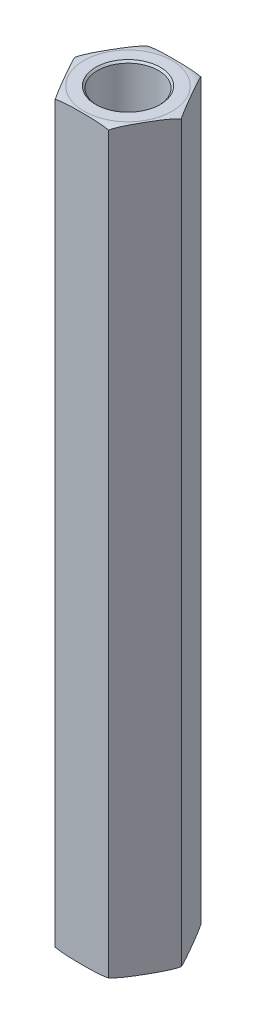
ISO-10303-21;
HEADER;
FILE_DESCRIPTION(('STEP AP214'),'2;1');
FILE_NAME('part.step','',(''),(''),'','','');
FILE_SCHEMA(('AUTOMOTIVE_DESIGN { 1 0 10303 214 1 1 1 1 }'));
ENDSEC;
DATA;
#1=APPLICATION_CONTEXT('core data for automotive mechanical design processes');
#2=APPLICATION_PROTOCOL_DEFINITION('international standard','automotive_design',2000,#1);
#3=PRODUCT_CONTEXT('',#1,'mechanical');
#4=PRODUCT('Part','Part','',(#3));
#5=PRODUCT_RELATED_PRODUCT_CATEGORY('part','',(#4));
#6=PRODUCT_DEFINITION_FORMATION('','',#4);
#7=PRODUCT_DEFINITION_CONTEXT('part definition',#1,'design');
#8=PRODUCT_DEFINITION('design','',#6,#7);
#9=PRODUCT_DEFINITION_SHAPE('','',#8);
#10=(LENGTH_UNIT() NAMED_UNIT(*) SI_UNIT(.MILLI.,.METRE.));
#11=(NAMED_UNIT(*) PLANE_ANGLE_UNIT() SI_UNIT($,.RADIAN.));
#12=(NAMED_UNIT(*) SI_UNIT($,.STERADIAN.) SOLID_ANGLE_UNIT());
#13=UNCERTAINTY_MEASURE_WITH_UNIT(LENGTH_MEASURE(1.E-05),#10,'distance_accuracy_value','');
#14=(GEOMETRIC_REPRESENTATION_CONTEXT(3) GLOBAL_UNCERTAINTY_ASSIGNED_CONTEXT((#13)) GLOBAL_UNIT_ASSIGNED_CONTEXT((#10,
#11,#12)) REPRESENTATION_CONTEXT('',''));
#15=CARTESIAN_POINT('',(0.,0.,0.));
#16=DIRECTION('',(0.,0.,1.));
#17=DIRECTION('',(1.,0.,0.));
#18=AXIS2_PLACEMENT_3D('',#15,#16,#17);
#19=CARTESIAN_POINT('',(0.,12.7,0.));
#20=DIRECTION('',(0.,1.,0.));
#21=DIRECTION('',(0.,0.,1.));
#22=AXIS2_PLACEMENT_3D('',#19,#20,#21);
#23=PLANE('',#22);
#24=CARTESIAN_POINT('',(0.,12.7,0.));
#25=DIRECTION('',(0.,1.,0.));
#26=DIRECTION('',(0.,0.,1.));
#27=AXIS2_PLACEMENT_3D('',#24,#25,#26);
#28=CIRCLE('',#27,2.0955);
#29=CARTESIAN_POINT('',(0.,12.7,2.0955));
#30=VERTEX_POINT('',#29);
#31=EDGE_CURVE('E302',#30,#30,#28,.T.);
#32=ORIENTED_EDGE('',*,*,#31,.T.);
#33=EDGE_LOOP('',(#32));
#34=FACE_BOUND('',#33,.T.);
#35=ADVANCED_FACE('F16',(#34),#23,.T.);
#36=CARTESIAN_POINT('',(0.,-12.7,0.));
#37=DIRECTION('',(0.,-1.,0.));
#38=DIRECTION('',(0.,0.,-1.));
#39=AXIS2_PLACEMENT_3D('',#36,#37,#38);
#40=PLANE('',#39);
#41=CARTESIAN_POINT('',(0.,-12.7,0.));
#42=DIRECTION('',(0.,-1.,0.));
#43=DIRECTION('',(0.,0.,-1.));
#44=AXIS2_PLACEMENT_3D('',#41,#42,#43);
#45=CIRCLE('',#44,2.0955);
#46=CARTESIAN_POINT('',(0.,-12.7,-2.0955));
#47=VERTEX_POINT('',#46);
#48=EDGE_CURVE('E312',#47,#47,#45,.T.);
#49=ORIENTED_EDGE('',*,*,#48,.T.);
#50=EDGE_LOOP('',(#49));
#51=FACE_BOUND('',#50,.T.);
#52=ADVANCED_FACE('F407',(#51),#40,.T.);
#53=CARTESIAN_POINT('',(0.,12.7,0.));
#54=DIRECTION('',(0.,1.,0.));
#55=DIRECTION('',(0.,0.,1.));
#56=AXIS2_PLACEMENT_3D('',#53,#54,#55);
#57=CYLINDRICAL_SURFACE('',#56,2.0955);
#58=CARTESIAN_POINT('',(0.,25.2729999999701,0.));
#59=DIRECTION('',(0.,1.,0.));
#60=DIRECTION('',(0.,0.,1.));
#61=AXIS2_PLACEMENT_3D('',#58,#59,#60);
#62=CIRCLE('',#61,2.09549999993897);
#63=CARTESIAN_POINT('',(0.,25.2729999999701,2.09549999993897));
#64=VERTEX_POINT('',#63);
#65=EDGE_CURVE('E314',#64,#64,#62,.T.);
#66=ORIENTED_EDGE('',*,*,#65,.T.);
#67=EDGE_LOOP('',(#66));
#68=FACE_BOUND('',#67,.T.);
#69=ORIENTED_EDGE('',*,*,#31,.F.);
#70=EDGE_LOOP('',(#69));
#71=FACE_BOUND('',#70,.T.);
#72=ADVANCED_FACE('F324',(#68,#71),#57,.F.);
#73=CARTESIAN_POINT('',(0.,-12.7,0.));
#74=DIRECTION('',(0.,-1.,0.));
#75=DIRECTION('',(0.,0.,-1.));
#76=AXIS2_PLACEMENT_3D('',#73,#74,#75);
#77=CYLINDRICAL_SURFACE('',#76,2.0955);
#78=ORIENTED_EDGE('',*,*,#48,.F.);
#79=EDGE_LOOP('',(#78));
#80=FACE_BOUND('',#79,.T.);
#81=CARTESIAN_POINT('',(0.,-25.2729999999701,0.));
#82=DIRECTION('',(0.,-1.,0.));
#83=DIRECTION('',(0.,0.,-1.));
#84=AXIS2_PLACEMENT_3D('',#81,#82,#83);
#85=CIRCLE('',#84,2.09549999999581);
#86=CARTESIAN_POINT('',(0.,-25.2729999999701,-2.09549999999581));
#87=VERTEX_POINT('',#86);
#88=EDGE_CURVE('E154',#87,#87,#85,.T.);
#89=ORIENTED_EDGE('',*,*,#88,.T.);
#90=EDGE_LOOP('',(#89));
#91=FACE_BOUND('',#90,.T.);
#92=ADVANCED_FACE('F329',(#80,#91),#77,.F.);
#93=CARTESIAN_POINT('',(0.,25.3999999998769,0.));
#94=DIRECTION('',(0.,1.,0.));
#95=DIRECTION('',(-1.,0.,0.));
#96=AXIS2_PLACEMENT_3D('',#93,#94,#95);
#97=CONICAL_SURFACE('',#96,2.2224999998457,0.785398163397448);
#98=CARTESIAN_POINT('',(0.,25.3999999999905,0.));
#99=DIRECTION('',(0.,1.,0.));
#100=DIRECTION('',(-1.,0.,0.));
#101=AXIS2_PLACEMENT_3D('',#98,#99,#100);
#102=CIRCLE('',#101,2.22249999995938);
#103=CARTESIAN_POINT('',(-2.22249999995938,25.3999999999905,0.));
#104=VERTEX_POINT('',#103);
#105=EDGE_CURVE('E79',#104,#104,#102,.T.);
#106=ORIENTED_EDGE('',*,*,#105,.T.);
#107=EDGE_LOOP('',(#106));
#108=FACE_BOUND('',#107,.T.);
#109=ORIENTED_EDGE('',*,*,#65,.F.);
#110=EDGE_LOOP('',(#109));
#111=FACE_BOUND('',#110,.T.);
#112=ADVANCED_FACE('F327',(#108,#111),#97,.F.);
#113=CARTESIAN_POINT('',(-3.66617420935413,25.4,0.));
#114=DIRECTION('',(0.866025403784439,0.,-0.499999999999999));
#115=DIRECTION('',(-0.499999999999999,0.,-0.866025403784439));
#116=AXIS2_PLACEMENT_3D('',#113,#114,#115);
#117=PLANE('',#116);
#118=DIRECTION('',(0.,1.,0.));
#119=VECTOR('',#118,1.);
#120=CARTESIAN_POINT('',(-1.83308710467708,25.4,3.175));
#121=LINE('',#120,#119);
#122=CARTESIAN_POINT('',(-1.83308710467707,-25.273,3.17499999999999));
#123=VERTEX_POINT('',#122);
#124=CARTESIAN_POINT('',(-1.83308710467706,25.273,3.175));
#125=VERTEX_POINT('',#124);
#126=EDGE_CURVE('E75',#123,#125,#121,.T.);
#127=ORIENTED_EDGE('',*,*,#126,.T.);
#128=CARTESIAN_POINT('',(-3.66617420935412,25.273,0.));
#129=CARTESIAN_POINT('',(-3.62797961467395,25.2889014148997,0.0661549785605581));
#130=CARTESIAN_POINT('',(-3.58956810864158,25.3024886076105,0.132685658603871));
#131=CARTESIAN_POINT('',(-3.51249051795712,25.3258161979402,0.266187961794345));
#132=CARTESIAN_POINT('',(-3.47382473049848,25.3355604771397,0.333159070187372));
#133=CARTESIAN_POINT('',(-3.39641631867875,25.3519966530451,0.467234372392355));
#134=CARTESIAN_POINT('',(-3.35767399633315,25.3586945328669,0.534338043098154));
#135=CARTESIAN_POINT('',(-3.28009834620116,25.3697767572932,0.668703010556943));
#136=CARTESIAN_POINT('',(-3.24126499587774,25.374160450474,0.735964346345226));
#137=CARTESIAN_POINT('',(-3.16354065964318,25.3812403004263,0.870586845688048));
#138=CARTESIAN_POINT('',(-3.1246496537448,25.3839355237591,0.937948043861515));
#139=CARTESIAN_POINT('',(-3.04685144594597,25.3881531983713,1.07269849250688));
#140=CARTESIAN_POINT('',(-3.00794424351974,25.3896756080272,1.14008774388949));
#141=CARTESIAN_POINT('',(-2.93051517598878,25.391922705889,1.27419882283578));
#142=CARTESIAN_POINT('',(-2.8919933624894,25.3926552468181,1.34092056101641));
#143=CARTESIAN_POINT('',(-2.81494778346149,25.3935767302574,1.4743674183913));
#144=CARTESIAN_POINT('',(-2.77642401791445,25.3937656658949,1.54109253761765));
#145=CARTESIAN_POINT('',(-2.69935964431019,25.3936659966806,1.67457194815371));
#146=CARTESIAN_POINT('',(-2.66081903631828,25.3933771811766,1.74132623935029));
#147=CARTESIAN_POINT('',(-2.58373908085337,25.392221986219,1.87483263846066));
#148=CARTESIAN_POINT('',(-2.54519973341253,25.3913555970386,1.94158474631875));
#149=CARTESIAN_POINT('',(-2.46812969629779,25.3887861940656,2.0750739663427));
#150=CARTESIAN_POINT('',(-2.42959900625973,25.3870832271617,2.1418110791393));
#151=CARTESIAN_POINT('',(-2.35255651340917,25.3824387229726,2.27525259109823));
#152=CARTESIAN_POINT('',(-2.31404470975451,25.3794972471358,2.34195699171921));
#153=CARTESIAN_POINT('',(-2.25084206239953,25.3732174124749,2.4514271881109));
#154=CARTESIAN_POINT('',(-2.22613849337018,25.3703980110463,2.49421502479802));
#155=CARTESIAN_POINT('',(-2.17676945272235,25.3638696794304,2.579724711521));
#156=CARTESIAN_POINT('',(-2.1521039703419,25.3601610809139,2.62244658019713));
#157=CARTESIAN_POINT('',(-2.10282753811702,25.3516802711497,2.70779586442636));
#158=CARTESIAN_POINT('',(-2.07821657107534,25.3469084657009,2.75042330976594));
#159=CARTESIAN_POINT('',(-2.02900094683554,25.3360987712516,2.83566727147549));
#160=CARTESIAN_POINT('',(-2.00439646085467,25.3300577313084,2.87828349128847));
#161=CARTESIAN_POINT('',(-1.95527325900936,25.3165138354161,2.96336737271501));
#162=CARTESIAN_POINT('',(-1.93075459617617,25.309010197803,3.00583494247576));
#163=CARTESIAN_POINT('',(-1.88182157373173,25.2923203507084,3.09058942351743));
#164=CARTESIAN_POINT('',(-1.85740744053271,25.2831314978033,3.13287594264089));
#165=CARTESIAN_POINT('',(-1.83308710467707,25.273,3.175));
#166=B_SPLINE_CURVE_WITH_KNOTS('',3,(#128,#129,#130,#131,#132,#133,#134,#135,#136,#137,#138,
#139,#140,#141,#142,#143,#144,#145,#146,#147,#148,#149,#150,#151,#152,#153,#154,#155,#156,#157,
#158,#159,#160,#161,#162,#163,#164,#165),.UNSPECIFIED.,.F.,.F.,(4,2,2,2,2,2,2,2,2,2,2,2,2,2,2,2,
2,2,4),(0.,0.233977307817926,0.467717675040663,0.700996973557454,0.934341903229689,
1.16781571967232,1.40129782179815,1.63243665809659,1.86357841666605,2.09482211846281,
2.3260697147148,2.55730435147381,2.78852751694395,2.93698369265072,3.08538458004461,
3.23372892334575,3.38244598546606,3.5312427462608,3.68027493713584),.UNSPECIFIED.);
#167=CARTESIAN_POINT('',(-3.66617420935412,25.273,0.));
#168=VERTEX_POINT('',#167);
#169=EDGE_CURVE('E68',#168,#125,#166,.T.);
#170=ORIENTED_EDGE('',*,*,#169,.F.);
#171=DIRECTION('',(0.,1.,0.));
#172=VECTOR('',#171,1.);
#173=CARTESIAN_POINT('',(-3.66617420935413,25.4,0.));
#174=LINE('',#173,#172);
#175=CARTESIAN_POINT('',(-3.66617420935413,-25.273,0.));
#176=VERTEX_POINT('',#175);
#177=EDGE_CURVE('E72',#168,#176,#174,.F.);
#178=ORIENTED_EDGE('',*,*,#177,.T.);
#179=CARTESIAN_POINT('',(-1.83308710467707,-25.273,3.17499999999999));
#180=CARTESIAN_POINT('',(-1.87128169935724,-25.2889014148997,3.10884502143944));
#181=CARTESIAN_POINT('',(-1.90969320538962,-25.3024886076105,3.04231434139612));
#182=CARTESIAN_POINT('',(-1.98677079607407,-25.3258161979402,2.90881203820565));
#183=CARTESIAN_POINT('',(-2.02543658353272,-25.3355604771397,2.84184092981262));
#184=CARTESIAN_POINT('',(-2.10284499535244,-25.3519966530451,2.70776562760764));
#185=CARTESIAN_POINT('',(-2.14158731769805,-25.3586945328669,2.64066195690184));
#186=CARTESIAN_POINT('',(-2.21916296783003,-25.3697767572932,2.50629698944305));
#187=CARTESIAN_POINT('',(-2.25799631815345,-25.374160450474,2.43903565365477));
#188=CARTESIAN_POINT('',(-2.33572065438801,-25.3812403004263,2.30441315431195));
#189=CARTESIAN_POINT('',(-2.3746116602864,-25.3839355237591,2.23705195613848));
#190=CARTESIAN_POINT('',(-2.45240986808522,-25.3881531983713,2.10230150749311));
#191=CARTESIAN_POINT('',(-2.49131707051146,-25.3896756080272,2.03491225611051));
#192=CARTESIAN_POINT('',(-2.56874613804241,-25.391922705889,1.90080117716421));
#193=CARTESIAN_POINT('',(-2.6072679515418,-25.3926552468181,1.83407943898358));
#194=CARTESIAN_POINT('',(-2.6843135305697,-25.3935767302574,1.70063258160869));
#195=CARTESIAN_POINT('',(-2.72283729611674,-25.3937656658949,1.63390746238234));
#196=CARTESIAN_POINT('',(-2.79990166972101,-25.3936659966806,1.50042805184629));
#197=CARTESIAN_POINT('',(-2.83844227771291,-25.3933771811766,1.43367376064971));
#198=CARTESIAN_POINT('',(-2.91552223317783,-25.392221986219,1.30016736153933));
#199=CARTESIAN_POINT('',(-2.95406158061867,-25.3913555970386,1.23341525368124));
#200=CARTESIAN_POINT('',(-3.03113161773341,-25.3887861940656,1.09992603365729));
#201=CARTESIAN_POINT('',(-3.06966230777146,-25.3870832271617,1.0331889208607));
#202=CARTESIAN_POINT('',(-3.14670480062202,-25.3824387229726,0.899747408901762));
#203=CARTESIAN_POINT('',(-3.18521660427668,-25.3794972471358,0.83304300828078));
#204=CARTESIAN_POINT('',(-3.24841925163166,-25.3732174124749,0.723572811889093));
#205=CARTESIAN_POINT('',(-3.27312282066101,-25.3703980110463,0.68078497520197));
#206=CARTESIAN_POINT('',(-3.32249186130884,-25.3638696794304,0.595275288478995));
#207=CARTESIAN_POINT('',(-3.34715734368929,-25.3601610809139,0.552553419802863));
#208=CARTESIAN_POINT('',(-3.39643377591418,-25.3516802711497,0.467204135573639));
#209=CARTESIAN_POINT('',(-3.42104474295585,-25.3469084657009,0.424576690234056));
#210=CARTESIAN_POINT('',(-3.47026036719565,-25.3360987712516,0.3393327285245));
#211=CARTESIAN_POINT('',(-3.49486485317652,-25.3300577313084,0.296716508711522));
#212=CARTESIAN_POINT('',(-3.54398805502183,-25.3165138354161,0.211632627284986));
#213=CARTESIAN_POINT('',(-3.56850671785503,-25.309010197803,0.169165057524237));
#214=CARTESIAN_POINT('',(-3.61743974029946,-25.2923203507084,0.0844105764825622));
#215=CARTESIAN_POINT('',(-3.64185387349848,-25.2831314978033,0.0421240573591058));
#216=CARTESIAN_POINT('',(-3.66617420935413,-25.273,0.));
#217=B_SPLINE_CURVE_WITH_KNOTS('',3,(#179,#180,#181,#182,#183,#184,#185,#186,#187,#188,#189,
#190,#191,#192,#193,#194,#195,#196,#197,#198,#199,#200,#201,#202,#203,#204,#205,#206,#207,#208,
#209,#210,#211,#212,#213,#214,#215,#216),.UNSPECIFIED.,.F.,.F.,(4,2,2,2,2,2,2,2,2,2,2,2,2,2,2,2,
2,2,4),(0.,0.233977307817926,0.467717675040663,0.700996973557454,0.934341903229688,
1.16781571967232,1.40129782179815,1.63243665809659,1.86357841666605,2.0948221184628,
2.3260697147148,2.55730435147381,2.78852751694395,2.93698369265072,3.08538458004461,
3.23372892334575,3.38244598546606,3.5312427462608,3.68027493713584),.UNSPECIFIED.);
#218=EDGE_CURVE('E87',#123,#176,#217,.T.);
#219=ORIENTED_EDGE('',*,*,#218,.F.);
#220=EDGE_LOOP('',(#127,#170,#178,#219));
#221=FACE_BOUND('',#220,.T.);
#222=ADVANCED_FACE('F70',(#221),#117,.F.);
#223=CARTESIAN_POINT('',(0.,-25.3999999998769,0.));
#224=DIRECTION('',(0.,-1.,0.));
#225=DIRECTION('',(1.,0.,0.));
#226=AXIS2_PLACEMENT_3D('',#223,#224,#225);
#227=CONICAL_SURFACE('',#226,2.22249999990254,0.785398163173655);
#228=ORIENTED_EDGE('',*,*,#88,.F.);
#229=EDGE_LOOP('',(#228));
#230=FACE_BOUND('',#229,.T.);
#231=CARTESIAN_POINT('',(0.,-25.3999999999337,0.));
#232=DIRECTION('',(0.,-1.,0.));
#233=DIRECTION('',(1.,0.,0.));
#234=AXIS2_PLACEMENT_3D('',#231,#232,#233);
#235=CIRCLE('',#234,2.22249999995938);
#236=CARTESIAN_POINT('',(2.22249999995938,-25.3999999999337,0.));
#237=VERTEX_POINT('',#236);
#238=EDGE_CURVE('E278',#237,#237,#235,.F.);
#239=ORIENTED_EDGE('',*,*,#238,.F.);
#240=EDGE_LOOP('',(#239));
#241=FACE_BOUND('',#240,.T.);
#242=ADVANCED_FACE('F336',(#230,#241),#227,.F.);
#243=CARTESIAN_POINT('',(-1.83308710467707,25.4,-3.175));
#244=DIRECTION('',(0.,-1.,0.));
#245=DIRECTION('',(0.,0.,-1.));
#246=AXIS2_PLACEMENT_3D('',#243,#244,#245);
#247=PLANE('',#246);
#248=CARTESIAN_POINT('',(0.,25.4,0.));
#249=DIRECTION('',(0.,-1.,0.));
#250=DIRECTION('',(0.,0.,1.));
#251=AXIS2_PLACEMENT_3D('',#248,#249,#250);
#252=CIRCLE('',#251,3.03117420935412);
#253=CARTESIAN_POINT('',(0.,25.4,3.03117420935412));
#254=VERTEX_POINT('',#253);
#255=CARTESIAN_POINT('',(0.,25.4,-3.03117420935412));
#256=VERTEX_POINT('',#255);
#257=EDGE_CURVE('E78',#254,#256,#252,.T.);
#258=ORIENTED_EDGE('',*,*,#257,.F.);
#259=CARTESIAN_POINT('',(0.,25.4,0.));
#260=DIRECTION('',(0.,-1.,0.));
#261=DIRECTION('',(0.,0.,-1.));
#262=AXIS2_PLACEMENT_3D('',#259,#260,#261);
#263=CIRCLE('',#262,3.03117420935412);
#264=EDGE_CURVE('E139',#256,#254,#263,.T.);
#265=ORIENTED_EDGE('',*,*,#264,.F.);
#266=EDGE_LOOP('',(#258,#265));
#267=FACE_BOUND('',#266,.T.);
#268=ORIENTED_EDGE('',*,*,#105,.F.);
#269=EDGE_LOOP('',(#268));
#270=FACE_BOUND('',#269,.T.);
#271=ADVANCED_FACE('F115',(#267,#270),#247,.F.);
#272=CARTESIAN_POINT('',(-1.83308710467707,25.4,-3.175));
#273=DIRECTION('',(0.866025403784439,0.,0.5));
#274=DIRECTION('',(0.5,0.,-0.866025403784439));
#275=AXIS2_PLACEMENT_3D('',#272,#273,#274);
#276=PLANE('',#275);
#277=ORIENTED_EDGE('',*,*,#177,.F.);
#278=CARTESIAN_POINT('',(-1.83308710467706,25.273,-3.17500000000001));
#279=CARTESIAN_POINT('',(-1.87128169935723,25.2889014148997,-3.10884502143946));
#280=CARTESIAN_POINT('',(-1.9096932053896,25.3024886076105,-3.04231434139615));
#281=CARTESIAN_POINT('',(-1.98677079607406,25.3258161979402,-2.90881203820568));
#282=CARTESIAN_POINT('',(-2.0254365835327,25.3355604771397,-2.84184092981265));
#283=CARTESIAN_POINT('',(-2.10284499535242,25.3519966530451,-2.70776562760767));
#284=CARTESIAN_POINT('',(-2.14158731769803,25.3586945328669,-2.64066195690188));
#285=CARTESIAN_POINT('',(-2.21916296783001,25.3697767572932,-2.50629698944309));
#286=CARTESIAN_POINT('',(-2.25799631815343,25.374160450474,-2.43903565365481));
#287=CARTESIAN_POINT('',(-2.33572065438799,25.3812403004263,-2.30441315431199));
#288=CARTESIAN_POINT('',(-2.37461166028637,25.3839355237591,-2.23705195613853));
#289=CARTESIAN_POINT('',(-2.45240986808519,25.3881531983713,-2.10230150749317));
#290=CARTESIAN_POINT('',(-2.49131707051143,25.3896756080272,-2.03491225611056));
#291=CARTESIAN_POINT('',(-2.56874613804238,25.391922705889,-1.90080117716427));
#292=CARTESIAN_POINT('',(-2.60726795154177,25.3926552468181,-1.83407943898364));
#293=CARTESIAN_POINT('',(-2.68431353056967,25.3935767302574,-1.70063258160875));
#294=CARTESIAN_POINT('',(-2.72283729611671,25.3937656658949,-1.63390746238241));
#295=CARTESIAN_POINT('',(-2.79990166972097,25.3936659966806,-1.50042805184636));
#296=CARTESIAN_POINT('',(-2.83844227771288,25.3933771811766,-1.43367376064978));
#297=CARTESIAN_POINT('',(-2.91552223317778,25.392221986219,-1.30016736153941));
#298=CARTESIAN_POINT('',(-2.95406158061863,25.3913555970386,-1.23341525368132));
#299=CARTESIAN_POINT('',(-3.03113161773337,25.3887861940656,-1.09992603365738));
#300=CARTESIAN_POINT('',(-3.06966230777142,25.3870832271617,-1.03318892086078));
#301=CARTESIAN_POINT('',(-3.14670480062198,25.3824387229726,-0.899747408901851));
#302=CARTESIAN_POINT('',(-3.18521660427663,25.3794972471358,-0.83304300828087));
#303=CARTESIAN_POINT('',(-3.24841925163161,25.3732174124749,-0.723572811889181));
#304=CARTESIAN_POINT('',(-3.27312282066097,25.3703980110463,-0.680784975202054));
#305=CARTESIAN_POINT('',(-3.32249186130881,25.3638696794304,-0.595275288479069));
#306=CARTESIAN_POINT('',(-3.34715734368926,25.3601610809139,-0.552553419802932));
#307=CARTESIAN_POINT('',(-3.39643377591415,25.3516802711497,-0.467204135573698));
#308=CARTESIAN_POINT('',(-3.42104474295582,25.3469084657009,-0.42457669023411));
#309=CARTESIAN_POINT('',(-3.47026036719563,25.3360987712516,-0.339332728524545));
#310=CARTESIAN_POINT('',(-3.4948648531765,25.3300577313084,-0.296716508711561));
#311=CARTESIAN_POINT('',(-3.54398805502182,25.3165138354161,-0.211632627285015));
#312=CARTESIAN_POINT('',(-3.56850671785502,25.309010197803,-0.169165057524262));
#313=CARTESIAN_POINT('',(-3.61743974029946,25.2923203507084,-0.0844105764825773));
#314=CARTESIAN_POINT('',(-3.64185387349848,25.2831314978033,-0.0421240573591159));
#315=CARTESIAN_POINT('',(-3.66617420935413,25.273,0.));
#316=B_SPLINE_CURVE_WITH_KNOTS('',3,(#278,#279,#280,#281,#282,#283,#284,#285,#286,#287,#288,
#289,#290,#291,#292,#293,#294,#295,#296,#297,#298,#299,#300,#301,#302,#303,#304,#305,#306,#307,
#308,#309,#310,#311,#312,#313,#314,#315),.UNSPECIFIED.,.F.,.F.,(4,2,2,2,2,2,2,2,2,2,2,2,2,2,2,2,
2,2,4),(0.,0.23397730781792,0.46771767504065,0.700996973557435,0.934341903229662,
1.16781571967229,1.40129782179811,1.63243665809654,1.86357841666599,2.09482211846275,
2.32606971471473,2.55730435147374,2.78852751694387,2.93698369265066,3.08538458004457,
3.23372892334572,3.38244598546605,3.53124274626081,3.68027493713587),.UNSPECIFIED.);
#317=CARTESIAN_POINT('',(-1.83308710467705,25.273,-3.17500000000001));
#318=VERTEX_POINT('',#317);
#319=EDGE_CURVE('E84',#318,#168,#316,.T.);
#320=ORIENTED_EDGE('',*,*,#319,.F.);
#321=DIRECTION('',(0.,1.,0.));
#322=VECTOR('',#321,1.);
#323=CARTESIAN_POINT('',(-1.83308710467704,25.4,-3.175));
#324=LINE('',#323,#322);
#325=CARTESIAN_POINT('',(-1.83308710467707,-25.273,-3.175));
#326=VERTEX_POINT('',#325);
#327=EDGE_CURVE('E177',#318,#326,#324,.F.);
#328=ORIENTED_EDGE('',*,*,#327,.T.);
#329=CARTESIAN_POINT('',(-3.66617420935413,-25.273,0.));
#330=CARTESIAN_POINT('',(-3.62797961467396,-25.2889014148997,-0.0661549785605592));
#331=CARTESIAN_POINT('',(-3.58956810864158,-25.3024886076105,-0.132685658603871));
#332=CARTESIAN_POINT('',(-3.51249051795713,-25.3258161979402,-0.266187961794346));
#333=CARTESIAN_POINT('',(-3.47382473049848,-25.3355604771397,-0.333159070187372));
#334=CARTESIAN_POINT('',(-3.39641631867876,-25.3519966530451,-0.467234372392354));
#335=CARTESIAN_POINT('',(-3.35767399633315,-25.3586945328669,-0.534338043098152));
#336=CARTESIAN_POINT('',(-3.28009834620117,-25.3697767572932,-0.66870301055694));
#337=CARTESIAN_POINT('',(-3.24126499587775,-25.374160450474,-0.735964346345222));
#338=CARTESIAN_POINT('',(-3.16354065964319,-25.3812403004263,-0.870586845688043));
#339=CARTESIAN_POINT('',(-3.1246496537448,-25.3839355237591,-0.937948043861509));
#340=CARTESIAN_POINT('',(-3.04685144594598,-25.3881531983713,-1.07269849250688));
#341=CARTESIAN_POINT('',(-3.00794424351975,-25.3896756080272,-1.14008774388948));
#342=CARTESIAN_POINT('',(-2.93051517598879,-25.391922705889,-1.27419882283578));
#343=CARTESIAN_POINT('',(-2.8919933624894,-25.3926552468181,-1.3409205610164));
#344=CARTESIAN_POINT('',(-2.8149477834615,-25.3935767302574,-1.4743674183913));
#345=CARTESIAN_POINT('',(-2.77642401791446,-25.3937656658949,-1.54109253761764));
#346=CARTESIAN_POINT('',(-2.6993596443102,-25.3936659966806,-1.6745719481537));
#347=CARTESIAN_POINT('',(-2.66081903631829,-25.3933771811766,-1.74132623935028));
#348=CARTESIAN_POINT('',(-2.58373908085338,-25.392221986219,-1.87483263846065));
#349=CARTESIAN_POINT('',(-2.54519973341254,-25.3913555970386,-1.94158474631874));
#350=CARTESIAN_POINT('',(-2.4681296962978,-25.3887861940656,-2.07507396634269));
#351=CARTESIAN_POINT('',(-2.42959900625974,-25.3870832271617,-2.14181107913928));
#352=CARTESIAN_POINT('',(-2.35255651340918,-25.3824387229726,-2.27525259109822));
#353=CARTESIAN_POINT('',(-2.31404470975452,-25.3794972471358,-2.3419569917192));
#354=CARTESIAN_POINT('',(-2.25084206239954,-25.3732174124749,-2.45142718811088));
#355=CARTESIAN_POINT('',(-2.22613849337019,-25.3703980110463,-2.49421502479801));
#356=CARTESIAN_POINT('',(-2.17676945272236,-25.3638696794304,-2.57972471152098));
#357=CARTESIAN_POINT('',(-2.15210397034191,-25.3601610809139,-2.62244658019712));
#358=CARTESIAN_POINT('',(-2.10282753811703,-25.3516802711497,-2.70779586442634));
#359=CARTESIAN_POINT('',(-2.07821657107535,-25.3469084657009,-2.75042330976592));
#360=CARTESIAN_POINT('',(-2.02900094683555,-25.3360987712516,-2.83566727147548));
#361=CARTESIAN_POINT('',(-2.00439646085468,-25.3300577313084,-2.87828349128846));
#362=CARTESIAN_POINT('',(-1.95527325900937,-25.3165138354161,-2.963367372715));
#363=CARTESIAN_POINT('',(-1.93075459617617,-25.309010197803,-3.00583494247575));
#364=CARTESIAN_POINT('',(-1.88182157373174,-25.2923203507084,-3.09058942351742));
#365=CARTESIAN_POINT('',(-1.85740744053272,-25.2831314978033,-3.13287594264088));
#366=CARTESIAN_POINT('',(-1.83308710467707,-25.273,-3.17499999999999));
#367=B_SPLINE_CURVE_WITH_KNOTS('',3,(#329,#330,#331,#332,#333,#334,#335,#336,#337,#338,#339,
#340,#341,#342,#343,#344,#345,#346,#347,#348,#349,#350,#351,#352,#353,#354,#355,#356,#357,#358,
#359,#360,#361,#362,#363,#364,#365,#366),.UNSPECIFIED.,.F.,.F.,(4,2,2,2,2,2,2,2,2,2,2,2,2,2,2,2,
2,2,4),(0.,0.233977307817925,0.467717675040661,0.700996973557449,0.934341903229682,
1.16781571967231,1.40129782179814,1.63243665809658,1.86357841666603,2.09482211846279,
2.32606971471478,2.55730435147379,2.78852751694393,2.9369836926507,3.0853845800446,
3.23372892334574,3.38244598546605,3.53124274626079,3.68027493713583),.UNSPECIFIED.);
#368=EDGE_CURVE('E86',#176,#326,#367,.T.);
#369=ORIENTED_EDGE('',*,*,#368,.F.);
#370=EDGE_LOOP('',(#277,#320,#328,#369));
#371=FACE_BOUND('',#370,.T.);
#372=ADVANCED_FACE('F82',(#371),#276,.F.);
#373=CARTESIAN_POINT('',(-1.83308710467707,25.4,3.175));
#374=DIRECTION('',(0.,0.,-1.));
#375=DIRECTION('',(-1.,0.,0.));
#376=AXIS2_PLACEMENT_3D('',#373,#374,#375);
#377=PLANE('',#376);
#378=DIRECTION('',(0.,1.,0.));
#379=VECTOR('',#378,1.);
#380=CARTESIAN_POINT('',(1.83308710467706,25.4,3.17499999999999));
#381=LINE('',#380,#379);
#382=CARTESIAN_POINT('',(1.83308710467706,-25.273,3.17499999999999));
#383=VERTEX_POINT('',#382);
#384=CARTESIAN_POINT('',(1.83308710467706,25.273,3.17499999999999));
#385=VERTEX_POINT('',#384);
#386=EDGE_CURVE('E179',#383,#385,#381,.T.);
#387=ORIENTED_EDGE('',*,*,#386,.T.);
#388=CARTESIAN_POINT('',(-1.83308710467706,25.273,3.175));
#389=CARTESIAN_POINT('',(-1.73237579828683,25.2939400141518,3.175));
#390=CARTESIAN_POINT('',(-1.63096506893486,25.3108853495327,3.175));
#391=CARTESIAN_POINT('',(-1.42767146651469,25.3384971643984,3.175));
#392=CARTESIAN_POINT('',(-1.32579191427254,25.3491875658753,3.175));
#393=CARTESIAN_POINT('',(-1.12177634709138,25.3661280408079,3.175));
#394=CARTESIAN_POINT('',(-1.0196405664338,25.3723812707189,3.175));
#395=CARTESIAN_POINT('',(-0.815663681397376,25.3819028064183,3.175));
#396=CARTESIAN_POINT('',(-0.713823115514574,25.3851834044999,3.175));
#397=CARTESIAN_POINT('',(-0.510018485441651,25.3899454848703,3.175));
#398=CARTESIAN_POINT('',(-0.408054390577977,25.3914254100882,3.175));
#399=CARTESIAN_POINT('',(-0.204060200337871,25.3933146818379,3.175));
#400=CARTESIAN_POINT('',(-0.102030100168935,25.3937234241492,3.175));
#401=CARTESIAN_POINT('',(0.102030100168936,25.3937234241492,3.175));
#402=CARTESIAN_POINT('',(0.204060200337871,25.3933146818379,3.175));
#403=CARTESIAN_POINT('',(0.408054390577978,25.3914254100882,3.17499999999999));
#404=CARTESIAN_POINT('',(0.510018485441653,25.3899454848703,3.17499999999999));
#405=CARTESIAN_POINT('',(0.713823115514575,25.3851834044999,3.17499999999999));
#406=CARTESIAN_POINT('',(0.815663681397378,25.3819028064183,3.17499999999999));
#407=CARTESIAN_POINT('',(1.0196405664338,25.3723812707189,3.17499999999999));
#408=CARTESIAN_POINT('',(1.12177634709138,25.3661280408079,3.17499999999999));
#409=CARTESIAN_POINT('',(1.32579191427254,25.3491875658753,3.17499999999999));
#410=CARTESIAN_POINT('',(1.42767146651469,25.3384971643984,3.17499999999999));
#411=CARTESIAN_POINT('',(1.63096506893486,25.3108853495327,3.17499999999999));
#412=CARTESIAN_POINT('',(1.73237579828684,25.2939400141518,3.17499999999999));
#413=CARTESIAN_POINT('',(1.83308710467706,25.273,3.17499999999999));
#414=B_SPLINE_CURVE_WITH_KNOTS('',3,(#388,#389,#390,#391,#392,#393,#394,#395,#396,#397,#398,
#399,#400,#401,#402,#403,#404,#405,#406,#407,#408,#409,#410,#411,#412,#413),.UNSPECIFIED.,.F.,
.F.,(4,2,2,2,2,2,2,2,2,2,2,2,4),(0.,0.308333242342808,0.615479423308236,0.92240689113001,
1.2280592962085,1.53397581645216,1.84006485747889,2.14615389850562,2.45207041874928,
2.75772282382777,3.06465029164954,3.37179647261497,3.68012971495778),.UNSPECIFIED.);
#415=EDGE_CURVE('E273',#125,#385,#414,.T.);
#416=ORIENTED_EDGE('',*,*,#415,.F.);
#417=ORIENTED_EDGE('',*,*,#126,.F.);
#418=CARTESIAN_POINT('',(1.83308710467706,-25.273,3.17499999999999));
#419=CARTESIAN_POINT('',(1.73237579828684,-25.2939400141518,3.17499999999999));
#420=CARTESIAN_POINT('',(1.63096506893486,-25.3108853495327,3.17499999999999));
#421=CARTESIAN_POINT('',(1.4276714665147,-25.3384971643984,3.17499999999999));
#422=CARTESIAN_POINT('',(1.32579191427254,-25.3491875658753,3.17499999999999));
#423=CARTESIAN_POINT('',(1.12177634709138,-25.3661280408079,3.17499999999999));
#424=CARTESIAN_POINT('',(1.0196405664338,-25.3723812707189,3.17499999999999));
#425=CARTESIAN_POINT('',(0.815663681397379,-25.3819028064183,3.17499999999999));
#426=CARTESIAN_POINT('',(0.713823115514576,-25.3851834044999,3.17499999999999));
#427=CARTESIAN_POINT('',(0.510018485441653,-25.3899454848703,3.17499999999999));
#428=CARTESIAN_POINT('',(0.408054390577978,-25.3914254100882,3.17499999999999));
#429=CARTESIAN_POINT('',(0.204060200337871,-25.3933146818379,3.175));
#430=CARTESIAN_POINT('',(0.102030100168936,-25.3937234241492,3.175));
#431=CARTESIAN_POINT('',(-0.102030100168936,-25.3937234241492,3.175));
#432=CARTESIAN_POINT('',(-0.204060200337872,-25.3933146818379,3.175));
#433=CARTESIAN_POINT('',(-0.408054390577981,-25.3914254100882,3.175));
#434=CARTESIAN_POINT('',(-0.510018485441656,-25.3899454848703,3.175));
#435=CARTESIAN_POINT('',(-0.71382311551458,-25.3851834044999,3.175));
#436=CARTESIAN_POINT('',(-0.815663681397384,-25.3819028064183,3.175));
#437=CARTESIAN_POINT('',(-1.01964056643381,-25.3723812707189,3.175));
#438=CARTESIAN_POINT('',(-1.12177634709139,-25.3661280408079,3.175));
#439=CARTESIAN_POINT('',(-1.32579191427255,-25.3491875658753,3.175));
#440=CARTESIAN_POINT('',(-1.4276714665147,-25.3384971643984,3.175));
#441=CARTESIAN_POINT('',(-1.63096506893487,-25.3108853495327,3.175));
#442=CARTESIAN_POINT('',(-1.73237579828685,-25.2939400141518,3.175));
#443=CARTESIAN_POINT('',(-1.83308710467708,-25.273,3.175));
#444=B_SPLINE_CURVE_WITH_KNOTS('',3,(#418,#419,#420,#421,#422,#423,#424,#425,#426,#427,#428,
#429,#430,#431,#432,#433,#434,#435,#436,#437,#438,#439,#440,#441,#442,#443),.UNSPECIFIED.,.F.,
.F.,(4,2,2,2,2,2,2,2,2,2,2,2,4),(0.,0.308333242342808,0.615479423308238,0.922406891130012,
1.22805929620851,1.53397581645217,1.84006485747889,2.14615389850562,2.45207041874929,
2.75772282382778,3.06465029164956,3.37179647261499,3.6801297149578),.UNSPECIFIED.);
#445=EDGE_CURVE('E250',#383,#123,#444,.T.);
#446=ORIENTED_EDGE('',*,*,#445,.F.);
#447=EDGE_LOOP('',(#387,#416,#417,#446));
#448=FACE_BOUND('',#447,.T.);
#449=ADVANCED_FACE('F203',(#448),#377,.F.);
#450=CARTESIAN_POINT('',(-1.83308710467707,-25.4,-3.175));
#451=DIRECTION('',(0.,-1.,0.));
#452=DIRECTION('',(0.,0.,-1.));
#453=AXIS2_PLACEMENT_3D('',#450,#451,#452);
#454=PLANE('',#453);
#455=CARTESIAN_POINT('',(0.,-25.4,0.));
#456=DIRECTION('',(0.,1.,0.));
#457=DIRECTION('',(0.,0.,1.));
#458=AXIS2_PLACEMENT_3D('',#455,#456,#457);
#459=CIRCLE('',#458,3.03117420935413);
#460=CARTESIAN_POINT('',(0.,-25.4,3.03117420935412));
#461=VERTEX_POINT('',#460);
#462=CARTESIAN_POINT('',(0.,-25.4,-3.03117420935412));
#463=VERTEX_POINT('',#462);
#464=EDGE_CURVE('E189',#461,#463,#459,.T.);
#465=ORIENTED_EDGE('',*,*,#464,.F.);
#466=CARTESIAN_POINT('',(0.,-25.4,0.));
#467=DIRECTION('',(0.,1.,0.));
#468=DIRECTION('',(0.,0.,-1.));
#469=AXIS2_PLACEMENT_3D('',#466,#467,#468);
#470=CIRCLE('',#469,3.03117420935413);
#471=EDGE_CURVE('E182',#461,#463,#470,.F.);
#472=ORIENTED_EDGE('',*,*,#471,.T.);
#473=EDGE_LOOP('',(#465,#472));
#474=FACE_BOUND('',#473,.T.);
#475=ORIENTED_EDGE('',*,*,#238,.T.);
#476=EDGE_LOOP('',(#475));
#477=FACE_BOUND('',#476,.T.);
#478=ADVANCED_FACE('F194',(#474,#477),#454,.T.);
#479=CARTESIAN_POINT('',(1.83308710467706,25.4,3.17499999999999));
#480=DIRECTION('',(-0.866025403784439,0.,-0.5));
#481=DIRECTION('',(-0.5,0.,0.866025403784439));
#482=AXIS2_PLACEMENT_3D('',#479,#480,#481);
#483=PLANE('',#482);
#484=DIRECTION('',(0.,1.,0.));
#485=VECTOR('',#484,1.);
#486=CARTESIAN_POINT('',(3.66617420935412,25.4,0.));
#487=LINE('',#486,#485);
#488=CARTESIAN_POINT('',(3.66617420935412,-25.273,0.));
#489=VERTEX_POINT('',#488);
#490=CARTESIAN_POINT('',(3.66617420935412,25.273,0.));
#491=VERTEX_POINT('',#490);
#492=EDGE_CURVE('E235',#489,#491,#487,.T.);
#493=ORIENTED_EDGE('',*,*,#492,.T.);
#494=CARTESIAN_POINT('',(1.83308710467706,25.273,3.17499999999999));
#495=CARTESIAN_POINT('',(1.87128169935723,25.2889014148997,3.10884502143944));
#496=CARTESIAN_POINT('',(1.90969320538961,25.3024886076105,3.04231434139613));
#497=CARTESIAN_POINT('',(1.98677079607406,25.3258161979402,2.90881203820565));
#498=CARTESIAN_POINT('',(2.02543658353271,25.3355604771397,2.84184092981262));
#499=CARTESIAN_POINT('',(2.10284499535243,25.3519966530451,2.70776562760764));
#500=CARTESIAN_POINT('',(2.14158731769804,25.3586945328669,2.64066195690184));
#501=CARTESIAN_POINT('',(2.21916296783003,25.3697767572932,2.50629698944305));
#502=CARTESIAN_POINT('',(2.25799631815344,25.374160450474,2.43903565365477));
#503=CARTESIAN_POINT('',(2.335720654388,25.3812403004263,2.30441315431195));
#504=CARTESIAN_POINT('',(2.37461166028639,25.3839355237591,2.23705195613848));
#505=CARTESIAN_POINT('',(2.45240986808522,25.3881531983713,2.10230150749311));
#506=CARTESIAN_POINT('',(2.49131707051145,25.3896756080272,2.03491225611051));
#507=CARTESIAN_POINT('',(2.56874613804241,25.391922705889,1.90080117716421));
#508=CARTESIAN_POINT('',(2.60726795154179,25.3926552468181,1.83407943898358));
#509=CARTESIAN_POINT('',(2.6843135305697,25.3935767302574,1.70063258160869));
#510=CARTESIAN_POINT('',(2.72283729611674,25.3937656658949,1.63390746238234));
#511=CARTESIAN_POINT('',(2.799901669721,25.3936659966806,1.50042805184629));
#512=CARTESIAN_POINT('',(2.83844227771291,25.3933771811766,1.43367376064971));
#513=CARTESIAN_POINT('',(2.91552223317782,25.392221986219,1.30016736153933));
#514=CARTESIAN_POINT('',(2.95406158061866,25.3913555970386,1.23341525368124));
#515=CARTESIAN_POINT('',(3.0311316177334,25.3887861940656,1.09992603365729));
#516=CARTESIAN_POINT('',(3.06966230777146,25.3870832271617,1.0331889208607));
#517=CARTESIAN_POINT('',(3.14670480062202,25.3824387229726,0.899747408901762));
#518=CARTESIAN_POINT('',(3.18521660427668,25.3794972471358,0.833043008280781));
#519=CARTESIAN_POINT('',(3.24841925163166,25.3732174124749,0.723572811889094));
#520=CARTESIAN_POINT('',(3.27312282066101,25.3703980110463,0.680784975201971));
#521=CARTESIAN_POINT('',(3.32249186130884,25.3638696794304,0.595275288478997));
#522=CARTESIAN_POINT('',(3.34715734368929,25.3601610809139,0.552553419802865));
#523=CARTESIAN_POINT('',(3.39643377591417,25.3516802711497,0.467204135573642));
#524=CARTESIAN_POINT('',(3.42104474295585,25.3469084657009,0.424576690234059));
#525=CARTESIAN_POINT('',(3.47026036719565,25.3360987712516,0.339332728524504));
#526=CARTESIAN_POINT('',(3.49486485317651,25.3300577313084,0.296716508711526));
#527=CARTESIAN_POINT('',(3.54398805502182,25.3165138354161,0.21163262728499));
#528=CARTESIAN_POINT('',(3.56850671785502,25.309010197803,0.169165057524242));
#529=CARTESIAN_POINT('',(3.61743974029946,25.2923203507084,0.0844105764825679));
#530=CARTESIAN_POINT('',(3.64185387349848,25.2831314978033,0.0421240573591117));
#531=CARTESIAN_POINT('',(3.66617420935412,25.273,0.));
#532=B_SPLINE_CURVE_WITH_KNOTS('',3,(#494,#495,#496,#497,#498,#499,#500,#501,#502,#503,#504,
#505,#506,#507,#508,#509,#510,#511,#512,#513,#514,#515,#516,#517,#518,#519,#520,#521,#522,#523,
#524,#525,#526,#527,#528,#529,#530,#531),.UNSPECIFIED.,.F.,.F.,(4,2,2,2,2,2,2,2,2,2,2,2,2,2,2,2,
2,2,4),(0.,0.233977307817927,0.467717675040665,0.700996973557455,0.93434190322969,
1.16781571967232,1.40129782179816,1.63243665809659,1.86357841666605,2.09482211846281,
2.3260697147148,2.55730435147382,2.78852751694395,2.93698369265073,3.08538458004462,
3.23372892334575,3.38244598546606,3.5312427462608,3.68027493713584),.UNSPECIFIED.);
#533=EDGE_CURVE('E268',#385,#491,#532,.T.);
#534=ORIENTED_EDGE('',*,*,#533,.F.);
#535=ORIENTED_EDGE('',*,*,#386,.F.);
#536=CARTESIAN_POINT('',(3.66617420935412,-25.273,0.));
#537=CARTESIAN_POINT('',(3.62797961467395,-25.2889014148997,0.0661549785605577));
#538=CARTESIAN_POINT('',(3.58956810864157,-25.3024886076105,0.13268565860387));
#539=CARTESIAN_POINT('',(3.51249051795712,-25.3258161979402,0.266187961794346));
#540=CARTESIAN_POINT('',(3.47382473049847,-25.3355604771397,0.333159070187373));
#541=CARTESIAN_POINT('',(3.39641631867875,-25.3519966530451,0.467234372392356));
#542=CARTESIAN_POINT('',(3.35767399633314,-25.3586945328669,0.534338043098155));
#543=CARTESIAN_POINT('',(3.28009834620116,-25.3697767572932,0.668703010556944));
#544=CARTESIAN_POINT('',(3.24126499587774,-25.374160450474,0.735964346345227));
#545=CARTESIAN_POINT('',(3.16354065964318,-25.3812403004263,0.870586845688049));
#546=CARTESIAN_POINT('',(3.12464965374479,-25.3839355237591,0.937948043861516));
#547=CARTESIAN_POINT('',(3.04685144594596,-25.3881531983713,1.07269849250688));
#548=CARTESIAN_POINT('',(3.00794424351973,-25.3896756080272,1.14008774388949));
#549=CARTESIAN_POINT('',(2.93051517598877,-25.391922705889,1.27419882283579));
#550=CARTESIAN_POINT('',(2.89199336248939,-25.3926552468181,1.34092056101641));
#551=CARTESIAN_POINT('',(2.81494778346149,-25.3935767302574,1.47436741839131));
#552=CARTESIAN_POINT('',(2.77642401791444,-25.3937656658949,1.54109253761766));
#553=CARTESIAN_POINT('',(2.69935964431018,-25.3936659966806,1.67457194815371));
#554=CARTESIAN_POINT('',(2.66081903631827,-25.3933771811766,1.74132623935029));
#555=CARTESIAN_POINT('',(2.58373908085336,-25.392221986219,1.87483263846066));
#556=CARTESIAN_POINT('',(2.54519973341252,-25.3913555970386,1.94158474631875));
#557=CARTESIAN_POINT('',(2.46812969629778,-25.3887861940656,2.0750739663427));
#558=CARTESIAN_POINT('',(2.42959900625972,-25.3870832271617,2.1418110791393));
#559=CARTESIAN_POINT('',(2.35255651340916,-25.3824387229726,2.27525259109824));
#560=CARTESIAN_POINT('',(2.3140447097545,-25.3794972471358,2.34195699171922));
#561=CARTESIAN_POINT('',(2.25084206239952,-25.3732174124749,2.45142718811091));
#562=CARTESIAN_POINT('',(2.22613849337017,-25.3703980110463,2.49421502479803));
#563=CARTESIAN_POINT('',(2.17676945272234,-25.3638696794304,2.579724711521));
#564=CARTESIAN_POINT('',(2.15210397034189,-25.3601610809139,2.62244658019713));
#565=CARTESIAN_POINT('',(2.10282753811701,-25.3516802711497,2.70779586442636));
#566=CARTESIAN_POINT('',(2.07821657107533,-25.3469084657009,2.75042330976594));
#567=CARTESIAN_POINT('',(2.02900094683553,-25.3360987712516,2.83566727147549));
#568=CARTESIAN_POINT('',(2.00439646085467,-25.3300577313084,2.87828349128847));
#569=CARTESIAN_POINT('',(1.95527325900936,-25.3165138354161,2.96336737271501));
#570=CARTESIAN_POINT('',(1.93075459617616,-25.309010197803,3.00583494247575));
#571=CARTESIAN_POINT('',(1.88182157373172,-25.2923203507084,3.09058942351743));
#572=CARTESIAN_POINT('',(1.8574074405327,-25.2831314978033,3.13287594264088));
#573=CARTESIAN_POINT('',(1.83308710467706,-25.273,3.17499999999999));
#574=B_SPLINE_CURVE_WITH_KNOTS('',3,(#536,#537,#538,#539,#540,#541,#542,#543,#544,#545,#546,
#547,#548,#549,#550,#551,#552,#553,#554,#555,#556,#557,#558,#559,#560,#561,#562,#563,#564,#565,
#566,#567,#568,#569,#570,#571,#572,#573),.UNSPECIFIED.,.F.,.F.,(4,2,2,2,2,2,2,2,2,2,2,2,2,2,2,2,
2,2,4),(0.,0.233977307817927,0.467717675040665,0.700996973557456,0.934341903229692,
1.16781571967232,1.40129782179816,1.63243665809659,1.86357841666605,2.09482211846281,
2.3260697147148,2.55730435147382,2.78852751694396,2.93698369265073,3.08538458004462,
3.23372892334575,3.38244598546606,3.5312427462608,3.68027493713584),.UNSPECIFIED.);
#575=EDGE_CURVE('E255',#489,#383,#574,.T.);
#576=ORIENTED_EDGE('',*,*,#575,.F.);
#577=EDGE_LOOP('',(#493,#534,#535,#576));
#578=FACE_BOUND('',#577,.T.);
#579=ADVANCED_FACE('F167',(#578),#483,.F.);
#580=CARTESIAN_POINT('',(0.,23.7490000000001,0.));
#581=DIRECTION('',(0.,1.,0.));
#582=DIRECTION('',(0.,0.,1.));
#583=AXIS2_PLACEMENT_3D('',#580,#581,#582);
#584=TOROIDAL_SURFACE('',#583,3.03117420935414,1.65099999999989);
#585=ORIENTED_EDGE('',*,*,#257,.T.);
#586=ORIENTED_EDGE('',*,*,#264,.T.);
#587=EDGE_LOOP('',(#585,#586));
#588=FACE_BOUND('',#587,.T.);
#589=ORIENTED_EDGE('',*,*,#533,.T.);
#590=CARTESIAN_POINT('',(3.66617420935412,25.273,0.));
#591=CARTESIAN_POINT('',(3.62797961467395,25.2889014148997,-0.0661549785605518));
#592=CARTESIAN_POINT('',(3.58956810864157,25.3024886076105,-0.132685658603865));
#593=CARTESIAN_POINT('',(3.51249051795712,25.3258161979402,-0.26618796179434));
#594=CARTESIAN_POINT('',(3.47382473049848,25.3355604771397,-0.333159070187367));
#595=CARTESIAN_POINT('',(3.39641631867875,25.3519966530451,-0.46723437239235));
#596=CARTESIAN_POINT('',(3.35767399633314,25.3586945328669,-0.534338043098149));
#597=CARTESIAN_POINT('',(3.28009834620116,25.3697767572932,-0.668703010556938));
#598=CARTESIAN_POINT('',(3.24126499587774,25.374160450474,-0.735964346345221));
#599=CARTESIAN_POINT('',(3.16354065964318,25.3812403004263,-0.870586845688042));
#600=CARTESIAN_POINT('',(3.12464965374479,25.3839355237591,-0.937948043861509));
#601=CARTESIAN_POINT('',(3.04685144594597,25.3881531983713,-1.07269849250688));
#602=CARTESIAN_POINT('',(3.00794424351973,25.3896756080272,-1.14008774388948));
#603=CARTESIAN_POINT('',(2.93051517598878,25.391922705889,-1.27419882283578));
#604=CARTESIAN_POINT('',(2.89199336248939,25.3926552468181,-1.34092056101641));
#605=CARTESIAN_POINT('',(2.81494778346149,25.3935767302574,-1.4743674183913));
#606=CARTESIAN_POINT('',(2.77642401791445,25.3937656658949,-1.54109253761765));
#607=CARTESIAN_POINT('',(2.69935964431018,25.3936659966806,-1.6745719481537));
#608=CARTESIAN_POINT('',(2.66081903631827,25.3933771811766,-1.74132623935028));
#609=CARTESIAN_POINT('',(2.58373908085336,25.392221986219,-1.87483263846065));
#610=CARTESIAN_POINT('',(2.54519973341252,25.3913555970386,-1.94158474631874));
#611=CARTESIAN_POINT('',(2.46812969629778,25.3887861940656,-2.07507396634269));
#612=CARTESIAN_POINT('',(2.42959900625973,25.3870832271617,-2.14181107913929));
#613=CARTESIAN_POINT('',(2.35255651340916,25.3824387229726,-2.27525259109823));
#614=CARTESIAN_POINT('',(2.31404470975451,25.3794972471358,-2.34195699171921));
#615=CARTESIAN_POINT('',(2.25084206239952,25.3732174124749,-2.45142718811089));
#616=CARTESIAN_POINT('',(2.22613849337017,25.3703980110463,-2.49421502479802));
#617=CARTESIAN_POINT('',(2.17676945272234,25.3638696794304,-2.579724711521));
#618=CARTESIAN_POINT('',(2.15210397034189,25.3601610809139,-2.62244658019713));
#619=CARTESIAN_POINT('',(2.10282753811701,25.3516802711497,-2.70779586442635));
#620=CARTESIAN_POINT('',(2.07821657107533,25.3469084657009,-2.75042330976594));
#621=CARTESIAN_POINT('',(2.02900094683553,25.3360987712516,-2.83566727147549));
#622=CARTESIAN_POINT('',(2.00439646085466,25.3300577313084,-2.87828349128847));
#623=CARTESIAN_POINT('',(1.95527325900935,25.3165138354161,-2.96336737271501));
#624=CARTESIAN_POINT('',(1.93075459617616,25.309010197803,-3.00583494247576));
#625=CARTESIAN_POINT('',(1.88182157373172,25.2923203507084,-3.09058942351744));
#626=CARTESIAN_POINT('',(1.8574074405327,25.2831314978033,-3.13287594264089));
#627=CARTESIAN_POINT('',(1.83308710467706,25.273,-3.175));
#628=B_SPLINE_CURVE_WITH_KNOTS('',3,(#590,#591,#592,#593,#594,#595,#596,#597,#598,#599,#600,
#601,#602,#603,#604,#605,#606,#607,#608,#609,#610,#611,#612,#613,#614,#615,#616,#617,#618,#619,
#620,#621,#622,#623,#624,#625,#626,#627),.UNSPECIFIED.,.F.,.F.,(4,2,2,2,2,2,2,2,2,2,2,2,2,2,2,2,
2,2,4),(0.,0.233977307817927,0.467717675040664,0.700996973557455,0.93434190322969,
1.16781571967232,1.40129782179815,1.63243665809659,1.86357841666605,2.09482211846281,
2.3260697147148,2.55730435147381,2.78852751694395,2.93698369265072,3.08538458004462,
3.23372892334576,3.38244598546607,3.53124274626082,3.68027493713586),.UNSPECIFIED.);
#629=CARTESIAN_POINT('',(1.83308710467706,25.273,-3.175));
#630=VERTEX_POINT('',#629);
#631=EDGE_CURVE('E238',#491,#630,#628,.T.);
#632=ORIENTED_EDGE('',*,*,#631,.T.);
#633=CARTESIAN_POINT('',(1.83308710467706,25.273,-3.17500000000001));
#634=CARTESIAN_POINT('',(1.73237579828683,25.2939400141518,-3.175));
#635=CARTESIAN_POINT('',(1.63096506893486,25.3108853495327,-3.175));
#636=CARTESIAN_POINT('',(1.42767146651469,25.3384971643984,-3.175));
#637=CARTESIAN_POINT('',(1.32579191427254,25.3491875658753,-3.175));
#638=CARTESIAN_POINT('',(1.12177634709138,25.3661280408079,-3.175));
#639=CARTESIAN_POINT('',(1.0196405664338,25.3723812707189,-3.175));
#640=CARTESIAN_POINT('',(0.815663681397375,25.3819028064183,-3.175));
#641=CARTESIAN_POINT('',(0.713823115514573,25.3851834044999,-3.175));
#642=CARTESIAN_POINT('',(0.510018485441651,25.3899454848703,-3.175));
#643=CARTESIAN_POINT('',(0.408054390577977,25.3914254100882,-3.175));
#644=CARTESIAN_POINT('',(0.20406020033787,25.3933146818379,-3.175));
#645=CARTESIAN_POINT('',(0.102030100168935,25.3937234241492,-3.17500000000001));
#646=CARTESIAN_POINT('',(-0.102030100168934,25.3937234241492,-3.17500000000001));
#647=CARTESIAN_POINT('',(-0.204060200337869,25.3933146818379,-3.175));
#648=CARTESIAN_POINT('',(-0.408054390577974,25.3914254100882,-3.175));
#649=CARTESIAN_POINT('',(-0.510018485441648,25.3899454848703,-3.175));
#650=CARTESIAN_POINT('',(-0.713823115514569,25.3851834044999,-3.175));
#651=CARTESIAN_POINT('',(-0.815663681397371,25.3819028064183,-3.175));
#652=CARTESIAN_POINT('',(-1.01964056643379,25.3723812707189,-3.175));
#653=CARTESIAN_POINT('',(-1.12177634709137,25.3661280408079,-3.175));
#654=CARTESIAN_POINT('',(-1.32579191427253,25.3491875658753,-3.175));
#655=CARTESIAN_POINT('',(-1.42767146651468,25.3384971643984,-3.175));
#656=CARTESIAN_POINT('',(-1.63096506893485,25.3108853495327,-3.175));
#657=CARTESIAN_POINT('',(-1.73237579828682,25.2939400141518,-3.175));
#658=CARTESIAN_POINT('',(-1.83308710467705,25.273,-3.175));
#659=B_SPLINE_CURVE_WITH_KNOTS('',3,(#633,#634,#635,#636,#637,#638,#639,#640,#641,#642,#643,
#644,#645,#646,#647,#648,#649,#650,#651,#652,#653,#654,#655,#656,#657,#658),.UNSPECIFIED.,.F.,
.F.,(4,2,2,2,2,2,2,2,2,2,2,2,4),(0.,0.308333242342808,0.615479423308235,0.922406891130009,
1.2280592962085,1.53397581645216,1.84006485747889,2.14615389850561,2.45207041874927,
2.75772282382776,3.06465029164953,3.37179647261496,3.68012971495777),.UNSPECIFIED.);
#660=EDGE_CURVE('E92',#630,#318,#659,.T.);
#661=ORIENTED_EDGE('',*,*,#660,.T.);
#662=ORIENTED_EDGE('',*,*,#319,.T.);
#663=ORIENTED_EDGE('',*,*,#169,.T.);
#664=ORIENTED_EDGE('',*,*,#415,.T.);
#665=EDGE_LOOP('',(#589,#632,#661,#662,#663,#664));
#666=FACE_BOUND('',#665,.T.);
#667=ADVANCED_FACE('F90',(#588,#666),#584,.T.);
#668=CARTESIAN_POINT('',(1.83308710467706,25.4,-3.175));
#669=DIRECTION('',(0.,0.,1.));
#670=DIRECTION('',(1.,0.,0.));
#671=AXIS2_PLACEMENT_3D('',#668,#669,#670);
#672=PLANE('',#671);
#673=ORIENTED_EDGE('',*,*,#327,.F.);
#674=ORIENTED_EDGE('',*,*,#660,.F.);
#675=DIRECTION('',(0.,1.,0.));
#676=VECTOR('',#675,1.);
#677=CARTESIAN_POINT('',(1.83308710467706,25.4,-3.175));
#678=LINE('',#677,#676);
#679=CARTESIAN_POINT('',(1.83308710467706,-25.273,-3.175));
#680=VERTEX_POINT('',#679);
#681=EDGE_CURVE('E27',#630,#680,#678,.F.);
#682=ORIENTED_EDGE('',*,*,#681,.T.);
#683=CARTESIAN_POINT('',(-1.83308710467707,-25.273,-3.175));
#684=CARTESIAN_POINT('',(-1.73237579828685,-25.2939400141518,-3.175));
#685=CARTESIAN_POINT('',(-1.63096506893487,-25.3108853495327,-3.175));
#686=CARTESIAN_POINT('',(-1.4276714665147,-25.3384971643984,-3.175));
#687=CARTESIAN_POINT('',(-1.32579191427255,-25.3491875658753,-3.175));
#688=CARTESIAN_POINT('',(-1.12177634709139,-25.3661280408079,-3.175));
#689=CARTESIAN_POINT('',(-1.01964056643381,-25.3723812707189,-3.175));
#690=CARTESIAN_POINT('',(-0.815663681397384,-25.3819028064183,-3.175));
#691=CARTESIAN_POINT('',(-0.71382311551458,-25.3851834044999,-3.175));
#692=CARTESIAN_POINT('',(-0.510018485441656,-25.3899454848703,-3.175));
#693=CARTESIAN_POINT('',(-0.408054390577981,-25.3914254100882,-3.175));
#694=CARTESIAN_POINT('',(-0.204060200337873,-25.3933146818379,-3.175));
#695=CARTESIAN_POINT('',(-0.102030100168936,-25.3937234241492,-3.17500000000001));
#696=CARTESIAN_POINT('',(0.102030100168935,-25.3937234241492,-3.17500000000001));
#697=CARTESIAN_POINT('',(0.20406020033787,-25.3933146818379,-3.175));
#698=CARTESIAN_POINT('',(0.408054390577977,-25.3914254100882,-3.175));
#699=CARTESIAN_POINT('',(0.510018485441651,-25.3899454848703,-3.175));
#700=CARTESIAN_POINT('',(0.713823115514574,-25.3851834044999,-3.175));
#701=CARTESIAN_POINT('',(0.815663681397376,-25.3819028064183,-3.175));
#702=CARTESIAN_POINT('',(1.0196405664338,-25.3723812707189,-3.175));
#703=CARTESIAN_POINT('',(1.12177634709138,-25.3661280408079,-3.175));
#704=CARTESIAN_POINT('',(1.32579191427254,-25.3491875658753,-3.175));
#705=CARTESIAN_POINT('',(1.42767146651469,-25.3384971643984,-3.175));
#706=CARTESIAN_POINT('',(1.63096506893486,-25.3108853495327,-3.175));
#707=CARTESIAN_POINT('',(1.73237579828683,-25.2939400141518,-3.175));
#708=CARTESIAN_POINT('',(1.83308710467706,-25.273,-3.175));
#709=B_SPLINE_CURVE_WITH_KNOTS('',3,(#683,#684,#685,#686,#687,#688,#689,#690,#691,#692,#693,
#694,#695,#696,#697,#698,#699,#700,#701,#702,#703,#704,#705,#706,#707,#708),.UNSPECIFIED.,.F.,
.F.,(4,2,2,2,2,2,2,2,2,2,2,2,4),(0.,0.308333242342811,0.615479423308241,0.922406891130018,
1.22805929620851,1.53397581645217,1.84006485747891,2.14615389850563,2.45207041874929,
2.75772282382778,3.06465029164956,3.37179647261499,3.6801297149578),.UNSPECIFIED.);
#710=EDGE_CURVE('E35',#326,#680,#709,.T.);
#711=ORIENTED_EDGE('',*,*,#710,.F.);
#712=EDGE_LOOP('',(#673,#674,#682,#711));
#713=FACE_BOUND('',#712,.T.);
#714=ADVANCED_FACE('F166',(#713),#672,.F.);
#715=CARTESIAN_POINT('',(0.,-23.7490000000001,0.));
#716=DIRECTION('',(0.,-1.,0.));
#717=DIRECTION('',(0.,0.,1.));
#718=AXIS2_PLACEMENT_3D('',#715,#716,#717);
#719=TOROIDAL_SURFACE('',#718,3.03117420935414,1.65099999999989);
#720=ORIENTED_EDGE('',*,*,#464,.T.);
#721=ORIENTED_EDGE('',*,*,#471,.F.);
#722=EDGE_LOOP('',(#720,#721));
#723=FACE_BOUND('',#722,.T.);
#724=ORIENTED_EDGE('',*,*,#445,.T.);
#725=ORIENTED_EDGE('',*,*,#218,.T.);
#726=ORIENTED_EDGE('',*,*,#368,.T.);
#727=ORIENTED_EDGE('',*,*,#710,.T.);
#728=CARTESIAN_POINT('',(1.83308710467706,-25.273,-3.175));
#729=CARTESIAN_POINT('',(1.87128169935723,-25.2889014148997,-3.10884502143944));
#730=CARTESIAN_POINT('',(1.9096932053896,-25.3024886076105,-3.04231434139613));
#731=CARTESIAN_POINT('',(1.98677079607406,-25.3258161979402,-2.90881203820566));
#732=CARTESIAN_POINT('',(2.0254365835327,-25.3355604771397,-2.84184092981263));
#733=CARTESIAN_POINT('',(2.10284499535243,-25.3519966530451,-2.70776562760765));
#734=CARTESIAN_POINT('',(2.14158731769803,-25.3586945328669,-2.64066195690185));
#735=CARTESIAN_POINT('',(2.21916296783002,-25.3697767572932,-2.50629698944306));
#736=CARTESIAN_POINT('',(2.25799631815344,-25.374160450474,-2.43903565365478));
#737=CARTESIAN_POINT('',(2.335720654388,-25.3812403004263,-2.30441315431196));
#738=CARTESIAN_POINT('',(2.37461166028638,-25.3839355237591,-2.23705195613849));
#739=CARTESIAN_POINT('',(2.45240986808521,-25.3881531983713,-2.10230150749312));
#740=CARTESIAN_POINT('',(2.49131707051144,-25.3896756080272,-2.03491225611052));
#741=CARTESIAN_POINT('',(2.5687461380424,-25.391922705889,-1.90080117716422));
#742=CARTESIAN_POINT('',(2.60726795154178,-25.3926552468181,-1.83407943898359));
#743=CARTESIAN_POINT('',(2.68431353056969,-25.3935767302574,-1.7006325816087));
#744=CARTESIAN_POINT('',(2.72283729611673,-25.3937656658949,-1.63390746238235));
#745=CARTESIAN_POINT('',(2.79990166972099,-25.3936659966806,-1.5004280518463));
#746=CARTESIAN_POINT('',(2.8384422777129,-25.3933771811766,-1.43367376064972));
#747=CARTESIAN_POINT('',(2.91552223317781,-25.392221986219,-1.30016736153935));
#748=CARTESIAN_POINT('',(2.95406158061865,-25.3913555970386,-1.23341525368126));
#749=CARTESIAN_POINT('',(3.03113161773339,-25.3887861940656,-1.09992603365731));
#750=CARTESIAN_POINT('',(3.06966230777145,-25.3870832271617,-1.03318892086071));
#751=CARTESIAN_POINT('',(3.14670480062201,-25.3824387229726,-0.899747408901775));
#752=CARTESIAN_POINT('',(3.18521660427666,-25.3794972471358,-0.833043008280793));
#753=CARTESIAN_POINT('',(3.24841925163165,-25.3732174124749,-0.723572811889106));
#754=CARTESIAN_POINT('',(3.273122820661,-25.3703980110463,-0.680784975201982));
#755=CARTESIAN_POINT('',(3.32249186130883,-25.3638696794304,-0.595275288479006));
#756=CARTESIAN_POINT('',(3.34715734368928,-25.3601610809139,-0.552553419802873));
#757=CARTESIAN_POINT('',(3.39643377591417,-25.3516802711497,-0.467204135573648));
#758=CARTESIAN_POINT('',(3.42104474295584,-25.3469084657009,-0.424576690234065));
#759=CARTESIAN_POINT('',(3.47026036719564,-25.3360987712516,-0.339332728524507));
#760=CARTESIAN_POINT('',(3.49486485317651,-25.3300577313084,-0.296716508711528));
#761=CARTESIAN_POINT('',(3.54398805502182,-25.3165138354161,-0.21163262728499));
#762=CARTESIAN_POINT('',(3.56850671785502,-25.309010197803,-0.169165057524241));
#763=CARTESIAN_POINT('',(3.61743974029946,-25.2923203507084,-0.0844105764825657));
#764=CARTESIAN_POINT('',(3.64185387349848,-25.2831314978033,-0.0421240573591085));
#765=CARTESIAN_POINT('',(3.66617420935412,-25.273,0.));
#766=B_SPLINE_CURVE_WITH_KNOTS('',3,(#728,#729,#730,#731,#732,#733,#734,#735,#736,#737,#738,
#739,#740,#741,#742,#743,#744,#745,#746,#747,#748,#749,#750,#751,#752,#753,#754,#755,#756,#757,
#758,#759,#760,#761,#762,#763,#764,#765),.UNSPECIFIED.,.F.,.F.,(4,2,2,2,2,2,2,2,2,2,2,2,2,2,2,2,
2,2,4),(0.,0.233977307817925,0.467717675040662,0.700996973557453,0.934341903229686,
1.16781571967232,1.40129782179815,1.63243665809659,1.86357841666604,2.0948221184628,
2.32606971471479,2.5573043514738,2.78852751694394,2.93698369265072,3.08538458004461,
3.23372892334575,3.38244598546606,3.53124274626081,3.68027493713585),.UNSPECIFIED.);
#767=EDGE_CURVE('E10',#680,#489,#766,.T.);
#768=ORIENTED_EDGE('',*,*,#767,.T.);
#769=ORIENTED_EDGE('',*,*,#575,.T.);
#770=EDGE_LOOP('',(#724,#725,#726,#727,#768,#769));
#771=FACE_BOUND('',#770,.T.);
#772=ADVANCED_FACE('F220',(#723,#771),#719,.T.);
#773=CARTESIAN_POINT('',(3.66617420935412,25.4,0.));
#774=DIRECTION('',(-0.866025403784439,0.,0.5));
#775=DIRECTION('',(0.5,0.,0.866025403784439));
#776=AXIS2_PLACEMENT_3D('',#773,#774,#775);
#777=PLANE('',#776);
#778=ORIENTED_EDGE('',*,*,#681,.F.);
#779=ORIENTED_EDGE('',*,*,#631,.F.);
#780=ORIENTED_EDGE('',*,*,#492,.F.);
#781=ORIENTED_EDGE('',*,*,#767,.F.);
#782=EDGE_LOOP('',(#778,#779,#780,#781));
#783=FACE_BOUND('',#782,.T.);
#784=ADVANCED_FACE('F229',(#783),#777,.F.);
#785=CLOSED_SHELL('',(#35,#52,#72,#92,#112,#222,#242,#271,#372,#449,#478,#579,#667,#714,#772,#784));
#786=MANIFOLD_SOLID_BREP('B1',#785);
#787=ADVANCED_BREP_SHAPE_REPRESENTATION('',(#18,#786),#14);
#788=SHAPE_DEFINITION_REPRESENTATION(#9,#787);
ENDSEC;
END-ISO-10303-21;
